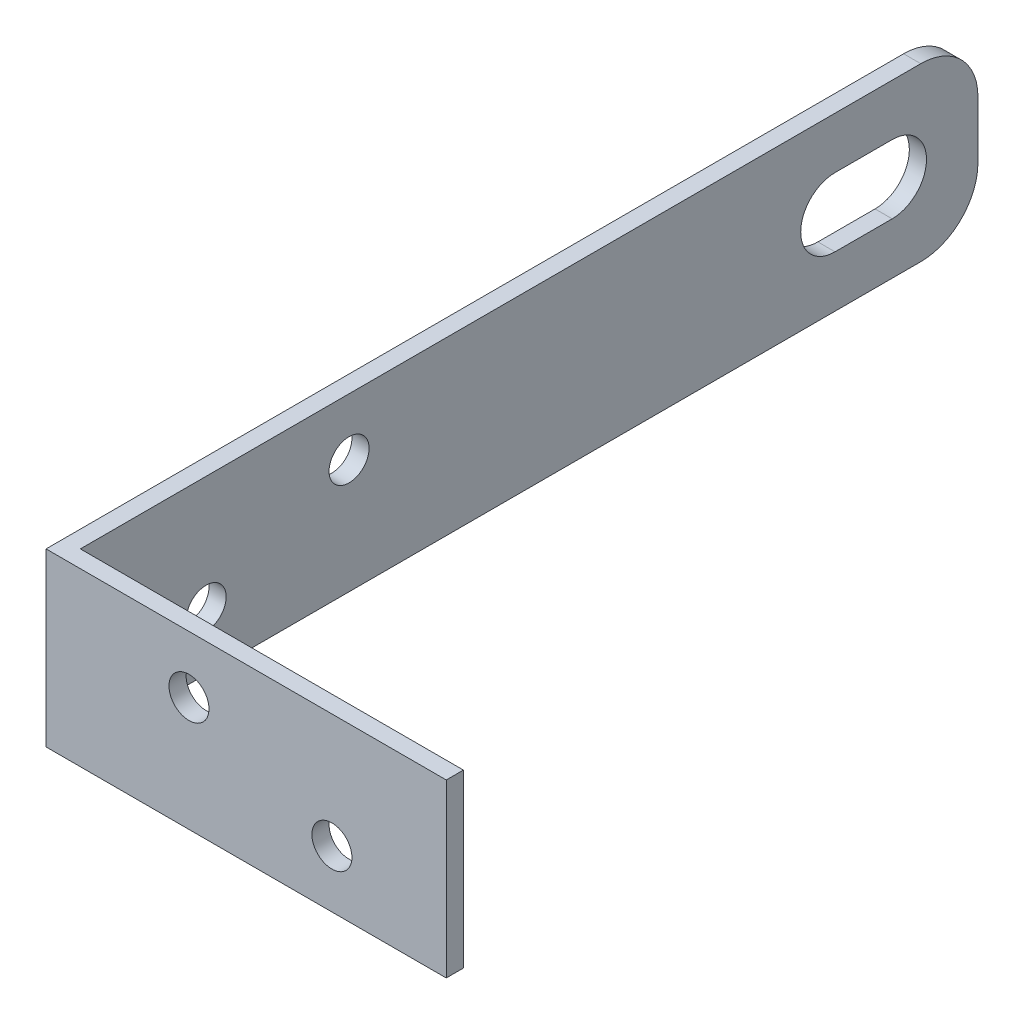
ISO-10303-21;
HEADER;
FILE_DESCRIPTION(('STEP AP214'),'2;1');
FILE_NAME('part.step','',(''),(''),'','','');
FILE_SCHEMA(('AUTOMOTIVE_DESIGN { 1 0 10303 214 1 1 1 1 }'));
ENDSEC;
DATA;
#1=APPLICATION_CONTEXT('core data for automotive mechanical design processes');
#2=APPLICATION_PROTOCOL_DEFINITION('international standard','automotive_design',2000,#1);
#3=PRODUCT_CONTEXT('',#1,'mechanical');
#4=PRODUCT('Part','Part','',(#3));
#5=PRODUCT_RELATED_PRODUCT_CATEGORY('part','',(#4));
#6=PRODUCT_DEFINITION_FORMATION('','',#4);
#7=PRODUCT_DEFINITION_CONTEXT('part definition',#1,'design');
#8=PRODUCT_DEFINITION('design','',#6,#7);
#9=PRODUCT_DEFINITION_SHAPE('','',#8);
#10=(LENGTH_UNIT() NAMED_UNIT(*) SI_UNIT(.MILLI.,.METRE.));
#11=(NAMED_UNIT(*) PLANE_ANGLE_UNIT() SI_UNIT($,.RADIAN.));
#12=(NAMED_UNIT(*) SI_UNIT($,.STERADIAN.) SOLID_ANGLE_UNIT());
#13=UNCERTAINTY_MEASURE_WITH_UNIT(LENGTH_MEASURE(1.E-05),#10,'distance_accuracy_value','');
#14=(GEOMETRIC_REPRESENTATION_CONTEXT(3) GLOBAL_UNCERTAINTY_ASSIGNED_CONTEXT((#13)) GLOBAL_UNIT_ASSIGNED_CONTEXT((#10,
#11,#12)) REPRESENTATION_CONTEXT('',''));
#15=CARTESIAN_POINT('',(0.,0.,0.));
#16=DIRECTION('',(0.,0.,1.));
#17=DIRECTION('',(1.,0.,0.));
#18=AXIS2_PLACEMENT_3D('',#15,#16,#17);
#19=CARTESIAN_POINT('',(0.,30.,-160.));
#20=DIRECTION('',(0.,0.,-1.));
#21=DIRECTION('',(-1.,0.,0.));
#22=AXIS2_PLACEMENT_3D('',#19,#20,#21);
#23=PLANE('',#22);
#24=DIRECTION('',(0.,-1.,0.));
#25=VECTOR('',#24,1.);
#26=CARTESIAN_POINT('',(0.,30.,-160.));
#27=LINE('',#26,#25);
#28=CARTESIAN_POINT('',(0.,20.,-160.));
#29=VERTEX_POINT('',#28);
#30=CARTESIAN_POINT('',(0.,10.,-160.));
#31=VERTEX_POINT('',#30);
#32=EDGE_CURVE('E135',#29,#31,#27,.T.);
#33=ORIENTED_EDGE('',*,*,#32,.F.);
#34=DIRECTION('',(-1.,0.,0.));
#35=VECTOR('',#34,1.);
#36=CARTESIAN_POINT('',(70.,20.,-160.));
#37=LINE('',#36,#35);
#38=CARTESIAN_POINT('',(3.,20.,-160.));
#39=VERTEX_POINT('',#38);
#40=EDGE_CURVE('E120',#39,#29,#37,.T.);
#41=ORIENTED_EDGE('',*,*,#40,.F.);
#42=DIRECTION('',(0.,-1.,0.));
#43=VECTOR('',#42,1.);
#44=CARTESIAN_POINT('',(3.,30.,-160.));
#45=LINE('',#44,#43);
#46=CARTESIAN_POINT('',(3.,10.,-160.));
#47=VERTEX_POINT('',#46);
#48=EDGE_CURVE('E141',#39,#47,#45,.T.);
#49=ORIENTED_EDGE('',*,*,#48,.T.);
#50=DIRECTION('',(-1.,0.,0.));
#51=VECTOR('',#50,1.);
#52=CARTESIAN_POINT('',(70.,10.,-160.));
#53=LINE('',#52,#51);
#54=EDGE_CURVE('E138',#47,#31,#53,.T.);
#55=ORIENTED_EDGE('',*,*,#54,.T.);
#56=EDGE_LOOP('',(#33,#41,#49,#55));
#57=FACE_BOUND('',#56,.T.);
#58=ADVANCED_FACE('F35',(#57),#23,.T.);
#59=CARTESIAN_POINT('',(0.,30.,0.));
#60=DIRECTION('',(0.,-1.,0.));
#61=DIRECTION('',(-1.,0.,0.));
#62=AXIS2_PLACEMENT_3D('',#59,#60,#61);
#63=PLANE('',#62);
#64=DIRECTION('',(-1.,0.,0.));
#65=VECTOR('',#64,1.);
#66=CARTESIAN_POINT('',(70.,30.,-150.));
#67=LINE('',#66,#65);
#68=CARTESIAN_POINT('',(0.,30.,-150.));
#69=VERTEX_POINT('',#68);
#70=CARTESIAN_POINT('',(3.,30.,-150.));
#71=VERTEX_POINT('',#70);
#72=EDGE_CURVE('E11',#69,#71,#67,.F.);
#73=ORIENTED_EDGE('',*,*,#72,.F.);
#74=DIRECTION('',(0.,0.,-1.));
#75=VECTOR('',#74,1.);
#76=CARTESIAN_POINT('',(0.,30.,-120.));
#77=LINE('',#76,#75);
#78=CARTESIAN_POINT('',(0.,30.,0.));
#79=VERTEX_POINT('',#78);
#80=EDGE_CURVE('E137',#79,#69,#77,.T.);
#81=ORIENTED_EDGE('',*,*,#80,.F.);
#82=DIRECTION('',(-1.,0.,0.));
#83=VECTOR('',#82,1.);
#84=CARTESIAN_POINT('',(0.,30.,0.));
#85=LINE('',#84,#83);
#86=CARTESIAN_POINT('',(70.,30.,0.));
#87=VERTEX_POINT('',#86);
#88=EDGE_CURVE('E222',#87,#79,#85,.T.);
#89=ORIENTED_EDGE('',*,*,#88,.F.);
#90=DIRECTION('',(0.,0.,1.));
#91=VECTOR('',#90,1.);
#92=CARTESIAN_POINT('',(70.,30.,-3.));
#93=LINE('',#92,#91);
#94=CARTESIAN_POINT('',(70.,30.,-3.));
#95=VERTEX_POINT('',#94);
#96=EDGE_CURVE('E210',#95,#87,#93,.T.);
#97=ORIENTED_EDGE('',*,*,#96,.F.);
#98=DIRECTION('',(1.,0.,0.));
#99=VECTOR('',#98,1.);
#100=CARTESIAN_POINT('',(0.,30.,-3.));
#101=LINE('',#100,#99);
#102=CARTESIAN_POINT('',(3.,30.,-3.));
#103=VERTEX_POINT('',#102);
#104=EDGE_CURVE('E202',#95,#103,#101,.F.);
#105=ORIENTED_EDGE('',*,*,#104,.T.);
#106=DIRECTION('',(0.,0.,-1.));
#107=VECTOR('',#106,1.);
#108=CARTESIAN_POINT('',(3.,30.,-120.));
#109=LINE('',#108,#107);
#110=EDGE_CURVE('E191',#103,#71,#109,.T.);
#111=ORIENTED_EDGE('',*,*,#110,.T.);
#112=EDGE_LOOP('',(#73,#81,#89,#97,#105,#111));
#113=FACE_BOUND('',#112,.T.);
#114=ADVANCED_FACE('F259',(#113),#63,.F.);
#115=CARTESIAN_POINT('',(0.,0.,0.));
#116=DIRECTION('',(0.,-1.,0.));
#117=DIRECTION('',(-1.,0.,0.));
#118=AXIS2_PLACEMENT_3D('',#115,#116,#117);
#119=PLANE('',#118);
#120=DIRECTION('',(0.,0.,-1.));
#121=VECTOR('',#120,1.);
#122=CARTESIAN_POINT('',(0.,0.,0.));
#123=LINE('',#122,#121);
#124=CARTESIAN_POINT('',(0.,0.,0.));
#125=VERTEX_POINT('',#124);
#126=CARTESIAN_POINT('',(0.,0.,-150.));
#127=VERTEX_POINT('',#126);
#128=EDGE_CURVE('E153',#125,#127,#123,.T.);
#129=ORIENTED_EDGE('',*,*,#128,.T.);
#130=DIRECTION('',(-1.,0.,0.));
#131=VECTOR('',#130,1.);
#132=CARTESIAN_POINT('',(70.,0.,-150.));
#133=LINE('',#132,#131);
#134=CARTESIAN_POINT('',(3.,0.,-150.));
#135=VERTEX_POINT('',#134);
#136=EDGE_CURVE('E42',#127,#135,#133,.F.);
#137=ORIENTED_EDGE('',*,*,#136,.T.);
#138=DIRECTION('',(0.,0.,-1.));
#139=VECTOR('',#138,1.);
#140=CARTESIAN_POINT('',(3.,0.,0.));
#141=LINE('',#140,#139);
#142=CARTESIAN_POINT('',(3.,0.,-3.));
#143=VERTEX_POINT('',#142);
#144=EDGE_CURVE('E183',#143,#135,#141,.T.);
#145=ORIENTED_EDGE('',*,*,#144,.F.);
#146=DIRECTION('',(1.,0.,0.));
#147=VECTOR('',#146,1.);
#148=CARTESIAN_POINT('',(0.,0.,-3.));
#149=LINE('',#148,#147);
#150=CARTESIAN_POINT('',(70.,0.,-3.));
#151=VERTEX_POINT('',#150);
#152=EDGE_CURVE('E192',#151,#143,#149,.F.);
#153=ORIENTED_EDGE('',*,*,#152,.F.);
#154=DIRECTION('',(0.,0.,1.));
#155=VECTOR('',#154,1.);
#156=CARTESIAN_POINT('',(70.,0.,-3.));
#157=LINE('',#156,#155);
#158=CARTESIAN_POINT('',(70.,0.,0.));
#159=VERTEX_POINT('',#158);
#160=EDGE_CURVE('E196',#151,#159,#157,.T.);
#161=ORIENTED_EDGE('',*,*,#160,.T.);
#162=DIRECTION('',(-1.,0.,0.));
#163=VECTOR('',#162,1.);
#164=CARTESIAN_POINT('',(0.,0.,0.));
#165=LINE('',#164,#163);
#166=EDGE_CURVE('E214',#159,#125,#165,.T.);
#167=ORIENTED_EDGE('',*,*,#166,.T.);
#168=EDGE_LOOP('',(#129,#137,#145,#153,#161,#167));
#169=FACE_BOUND('',#168,.T.);
#170=ADVANCED_FACE('F181',(#169),#119,.T.);
#171=CARTESIAN_POINT('',(0.,30.,0.));
#172=DIRECTION('',(-1.,0.,0.));
#173=DIRECTION('',(0.,0.,1.));
#174=AXIS2_PLACEMENT_3D('',#171,#172,#173);
#175=PLANE('',#174);
#176=CARTESIAN_POINT('',(0.,20.,-150.));
#177=DIRECTION('',(1.,0.,0.));
#178=DIRECTION('',(0.,0.,-1.));
#179=AXIS2_PLACEMENT_3D('',#176,#177,#178);
#180=CIRCLE('',#179,10.);
#181=EDGE_CURVE('E48',#29,#69,#180,.T.);
#182=ORIENTED_EDGE('',*,*,#181,.F.);
#183=ORIENTED_EDGE('',*,*,#32,.T.);
#184=CARTESIAN_POINT('',(0.,10.,-150.));
#185=DIRECTION('',(1.,0.,0.));
#186=DIRECTION('',(0.,0.,1.));
#187=AXIS2_PLACEMENT_3D('',#184,#185,#186);
#188=CIRCLE('',#187,10.);
#189=EDGE_CURVE('E256',#127,#31,#188,.T.);
#190=ORIENTED_EDGE('',*,*,#189,.F.);
#191=ORIENTED_EDGE('',*,*,#128,.F.);
#192=DIRECTION('',(0.,-1.,0.));
#193=VECTOR('',#192,1.);
#194=CARTESIAN_POINT('',(0.,30.,0.));
#195=LINE('',#194,#193);
#196=EDGE_CURVE('E142',#79,#125,#195,.T.);
#197=ORIENTED_EDGE('',*,*,#196,.F.);
#198=ORIENTED_EDGE('',*,*,#80,.T.);
#199=EDGE_LOOP('',(#182,#183,#190,#191,#197,#198));
#200=FACE_BOUND('',#199,.T.);
#201=CARTESIAN_POINT('',(0.,15.,-145.));
#202=DIRECTION('',(-1.,0.,0.));
#203=DIRECTION('',(0.,0.,1.));
#204=AXIS2_PLACEMENT_3D('',#201,#202,#203);
#205=CIRCLE('',#204,6.);
#206=CARTESIAN_POINT('',(0.,21.,-145.));
#207=VERTEX_POINT('',#206);
#208=CARTESIAN_POINT('',(0.,9.,-145.));
#209=VERTEX_POINT('',#208);
#210=EDGE_CURVE('E251',#207,#209,#205,.T.);
#211=ORIENTED_EDGE('',*,*,#210,.F.);
#212=DIRECTION('',(0.,0.,-1.));
#213=VECTOR('',#212,1.);
#214=CARTESIAN_POINT('',(0.,21.,-145.));
#215=LINE('',#214,#213);
#216=CARTESIAN_POINT('',(0.,21.,-135.));
#217=VERTEX_POINT('',#216);
#218=EDGE_CURVE('E238',#217,#207,#215,.T.);
#219=ORIENTED_EDGE('',*,*,#218,.F.);
#220=CARTESIAN_POINT('',(0.,15.,-135.));
#221=DIRECTION('',(-1.,0.,0.));
#222=DIRECTION('',(0.,0.,-1.));
#223=AXIS2_PLACEMENT_3D('',#220,#221,#222);
#224=CIRCLE('',#223,6.);
#225=CARTESIAN_POINT('',(0.,9.,-135.));
#226=VERTEX_POINT('',#225);
#227=EDGE_CURVE('E245',#226,#217,#224,.T.);
#228=ORIENTED_EDGE('',*,*,#227,.F.);
#229=DIRECTION('',(0.,0.,1.));
#230=VECTOR('',#229,1.);
#231=CARTESIAN_POINT('',(0.,9.,-145.));
#232=LINE('',#231,#230);
#233=EDGE_CURVE('E248',#209,#226,#232,.T.);
#234=ORIENTED_EDGE('',*,*,#233,.F.);
#235=EDGE_LOOP('',(#211,#219,#228,#234));
#236=FACE_BOUND('',#235,.T.);
#237=CARTESIAN_POINT('',(0.,10.,-25.));
#238=DIRECTION('',(-1.,0.,0.));
#239=DIRECTION('',(0.,0.,1.));
#240=AXIS2_PLACEMENT_3D('',#237,#238,#239);
#241=CIRCLE('',#240,3.50000000000002);
#242=CARTESIAN_POINT('',(0.,10.,-21.5));
#243=VERTEX_POINT('',#242);
#244=EDGE_CURVE('E158',#243,#243,#241,.T.);
#245=ORIENTED_EDGE('',*,*,#244,.F.);
#246=EDGE_LOOP('',(#245));
#247=FACE_BOUND('',#246,.T.);
#248=CARTESIAN_POINT('',(0.,20.,-50.));
#249=DIRECTION('',(-1.,0.,0.));
#250=DIRECTION('',(0.,0.,1.));
#251=AXIS2_PLACEMENT_3D('',#248,#249,#250);
#252=CIRCLE('',#251,3.5);
#253=CARTESIAN_POINT('',(0.,20.,-46.5));
#254=VERTEX_POINT('',#253);
#255=EDGE_CURVE('E154',#254,#254,#252,.T.);
#256=ORIENTED_EDGE('',*,*,#255,.F.);
#257=EDGE_LOOP('',(#256));
#258=FACE_BOUND('',#257,.T.);
#259=ADVANCED_FACE('F132',(#200,#236,#247,#258),#175,.T.);
#260=CARTESIAN_POINT('',(0.,30.,0.));
#261=DIRECTION('',(0.,0.,1.));
#262=DIRECTION('',(1.,0.,0.));
#263=AXIS2_PLACEMENT_3D('',#260,#261,#262);
#264=PLANE('',#263);
#265=CARTESIAN_POINT('',(50.,10.,0.));
#266=DIRECTION('',(0.,0.,1.));
#267=DIRECTION('',(1.,0.,0.));
#268=AXIS2_PLACEMENT_3D('',#265,#266,#267);
#269=CIRCLE('',#268,3.5);
#270=CARTESIAN_POINT('',(53.5,10.,0.));
#271=VERTEX_POINT('',#270);
#272=EDGE_CURVE('E166',#271,#271,#269,.T.);
#273=ORIENTED_EDGE('',*,*,#272,.F.);
#274=EDGE_LOOP('',(#273));
#275=FACE_BOUND('',#274,.T.);
#276=CARTESIAN_POINT('',(25.,20.,0.));
#277=DIRECTION('',(0.,0.,1.));
#278=DIRECTION('',(1.,0.,0.));
#279=AXIS2_PLACEMENT_3D('',#276,#277,#278);
#280=CIRCLE('',#279,3.5);
#281=CARTESIAN_POINT('',(28.5,20.,0.));
#282=VERTEX_POINT('',#281);
#283=EDGE_CURVE('E162',#282,#282,#280,.T.);
#284=ORIENTED_EDGE('',*,*,#283,.F.);
#285=EDGE_LOOP('',(#284));
#286=FACE_BOUND('',#285,.T.);
#287=ORIENTED_EDGE('',*,*,#166,.F.);
#288=DIRECTION('',(0.,-1.,0.));
#289=VECTOR('',#288,1.);
#290=CARTESIAN_POINT('',(70.,30.,0.));
#291=LINE('',#290,#289);
#292=EDGE_CURVE('E146',#87,#159,#291,.T.);
#293=ORIENTED_EDGE('',*,*,#292,.F.);
#294=ORIENTED_EDGE('',*,*,#88,.T.);
#295=ORIENTED_EDGE('',*,*,#196,.T.);
#296=EDGE_LOOP('',(#287,#293,#294,#295));
#297=FACE_BOUND('',#296,.T.);
#298=ADVANCED_FACE('F215',(#275,#286,#297),#264,.T.);
#299=CARTESIAN_POINT('',(70.,30.,-3.));
#300=DIRECTION('',(1.,0.,0.));
#301=DIRECTION('',(0.,0.,-1.));
#302=AXIS2_PLACEMENT_3D('',#299,#300,#301);
#303=PLANE('',#302);
#304=ORIENTED_EDGE('',*,*,#160,.F.);
#305=DIRECTION('',(0.,-1.,0.));
#306=VECTOR('',#305,1.);
#307=CARTESIAN_POINT('',(70.,30.,-3.));
#308=LINE('',#307,#306);
#309=EDGE_CURVE('E201',#95,#151,#308,.T.);
#310=ORIENTED_EDGE('',*,*,#309,.F.);
#311=ORIENTED_EDGE('',*,*,#96,.T.);
#312=ORIENTED_EDGE('',*,*,#292,.T.);
#313=EDGE_LOOP('',(#304,#310,#311,#312));
#314=FACE_BOUND('',#313,.T.);
#315=ADVANCED_FACE('F207',(#314),#303,.T.);
#316=CARTESIAN_POINT('',(0.,30.,-3.));
#317=DIRECTION('',(0.,0.,1.));
#318=DIRECTION('',(1.,0.,0.));
#319=AXIS2_PLACEMENT_3D('',#316,#317,#318);
#320=PLANE('',#319);
#321=CARTESIAN_POINT('',(50.,10.,-3.));
#322=DIRECTION('',(0.,0.,1.));
#323=DIRECTION('',(1.,0.,0.));
#324=AXIS2_PLACEMENT_3D('',#321,#322,#323);
#325=CIRCLE('',#324,3.5);
#326=CARTESIAN_POINT('',(53.5,10.,-3.));
#327=VERTEX_POINT('',#326);
#328=EDGE_CURVE('E163',#327,#327,#325,.T.);
#329=ORIENTED_EDGE('',*,*,#328,.T.);
#330=EDGE_LOOP('',(#329));
#331=FACE_BOUND('',#330,.T.);
#332=CARTESIAN_POINT('',(25.,20.,-3.));
#333=DIRECTION('',(0.,0.,1.));
#334=DIRECTION('',(1.,0.,0.));
#335=AXIS2_PLACEMENT_3D('',#332,#333,#334);
#336=CIRCLE('',#335,3.5);
#337=CARTESIAN_POINT('',(28.5,20.,-3.));
#338=VERTEX_POINT('',#337);
#339=EDGE_CURVE('E159',#338,#338,#336,.T.);
#340=ORIENTED_EDGE('',*,*,#339,.T.);
#341=EDGE_LOOP('',(#340));
#342=FACE_BOUND('',#341,.T.);
#343=ORIENTED_EDGE('',*,*,#152,.T.);
#344=DIRECTION('',(0.,-1.,0.));
#345=VECTOR('',#344,1.);
#346=CARTESIAN_POINT('',(3.,30.,-3.));
#347=LINE('',#346,#345);
#348=EDGE_CURVE('E190',#103,#143,#347,.T.);
#349=ORIENTED_EDGE('',*,*,#348,.F.);
#350=ORIENTED_EDGE('',*,*,#104,.F.);
#351=ORIENTED_EDGE('',*,*,#309,.T.);
#352=EDGE_LOOP('',(#343,#349,#350,#351));
#353=FACE_BOUND('',#352,.T.);
#354=ADVANCED_FACE('F262',(#331,#342,#353),#320,.F.);
#355=CARTESIAN_POINT('',(3.,30.,0.));
#356=DIRECTION('',(-1.,0.,0.));
#357=DIRECTION('',(0.,0.,1.));
#358=AXIS2_PLACEMENT_3D('',#355,#356,#357);
#359=PLANE('',#358);
#360=DIRECTION('',(0.,0.,-1.));
#361=VECTOR('',#360,1.);
#362=CARTESIAN_POINT('',(3.,21.,0.));
#363=LINE('',#362,#361);
#364=CARTESIAN_POINT('',(3.,21.,-135.));
#365=VERTEX_POINT('',#364);
#366=CARTESIAN_POINT('',(3.,21.,-145.));
#367=VERTEX_POINT('',#366);
#368=EDGE_CURVE('E172',#365,#367,#363,.T.);
#369=ORIENTED_EDGE('',*,*,#368,.T.);
#370=CARTESIAN_POINT('',(3.,15.,-145.));
#371=DIRECTION('',(-1.,0.,0.));
#372=DIRECTION('',(0.,0.,1.));
#373=AXIS2_PLACEMENT_3D('',#370,#371,#372);
#374=CIRCLE('',#373,6.);
#375=CARTESIAN_POINT('',(3.,9.,-145.));
#376=VERTEX_POINT('',#375);
#377=EDGE_CURVE('E175',#367,#376,#374,.T.);
#378=ORIENTED_EDGE('',*,*,#377,.T.);
#379=DIRECTION('',(0.,0.,1.));
#380=VECTOR('',#379,1.);
#381=CARTESIAN_POINT('',(3.,9.,0.));
#382=LINE('',#381,#380);
#383=CARTESIAN_POINT('',(3.,9.,-135.));
#384=VERTEX_POINT('',#383);
#385=EDGE_CURVE('E144',#376,#384,#382,.T.);
#386=ORIENTED_EDGE('',*,*,#385,.T.);
#387=CARTESIAN_POINT('',(3.,15.,-135.));
#388=DIRECTION('',(-1.,0.,0.));
#389=DIRECTION('',(0.,0.,1.));
#390=AXIS2_PLACEMENT_3D('',#387,#388,#389);
#391=CIRCLE('',#390,6.);
#392=EDGE_CURVE('E169',#384,#365,#391,.T.);
#393=ORIENTED_EDGE('',*,*,#392,.T.);
#394=EDGE_LOOP('',(#369,#378,#386,#393));
#395=FACE_BOUND('',#394,.T.);
#396=CARTESIAN_POINT('',(3.,10.,-25.));
#397=DIRECTION('',(-1.,0.,0.));
#398=DIRECTION('',(0.,0.,1.));
#399=AXIS2_PLACEMENT_3D('',#396,#397,#398);
#400=CIRCLE('',#399,3.50000000000002);
#401=CARTESIAN_POINT('',(3.,10.,-21.5));
#402=VERTEX_POINT('',#401);
#403=EDGE_CURVE('E155',#402,#402,#400,.T.);
#404=ORIENTED_EDGE('',*,*,#403,.T.);
#405=EDGE_LOOP('',(#404));
#406=FACE_BOUND('',#405,.T.);
#407=CARTESIAN_POINT('',(3.,20.,-50.));
#408=DIRECTION('',(-1.,0.,0.));
#409=DIRECTION('',(0.,0.,1.));
#410=AXIS2_PLACEMENT_3D('',#407,#408,#409);
#411=CIRCLE('',#410,3.5);
#412=CARTESIAN_POINT('',(3.,20.,-46.5));
#413=VERTEX_POINT('',#412);
#414=EDGE_CURVE('E150',#413,#413,#411,.T.);
#415=ORIENTED_EDGE('',*,*,#414,.T.);
#416=EDGE_LOOP('',(#415));
#417=FACE_BOUND('',#416,.T.);
#418=ORIENTED_EDGE('',*,*,#48,.F.);
#419=CARTESIAN_POINT('',(3.,20.,-150.));
#420=DIRECTION('',(-1.,0.,0.));
#421=DIRECTION('',(0.,0.,1.));
#422=AXIS2_PLACEMENT_3D('',#419,#420,#421);
#423=CIRCLE('',#422,10.);
#424=EDGE_CURVE('E123',#39,#71,#423,.F.);
#425=ORIENTED_EDGE('',*,*,#424,.T.);
#426=ORIENTED_EDGE('',*,*,#110,.F.);
#427=ORIENTED_EDGE('',*,*,#348,.T.);
#428=ORIENTED_EDGE('',*,*,#144,.T.);
#429=CARTESIAN_POINT('',(3.,10.,-150.));
#430=DIRECTION('',(-1.,0.,0.));
#431=DIRECTION('',(0.,0.,1.));
#432=AXIS2_PLACEMENT_3D('',#429,#430,#431);
#433=CIRCLE('',#432,10.);
#434=EDGE_CURVE('E56',#135,#47,#433,.F.);
#435=ORIENTED_EDGE('',*,*,#434,.T.);
#436=EDGE_LOOP('',(#418,#425,#426,#427,#428,#435));
#437=FACE_BOUND('',#436,.T.);
#438=ADVANCED_FACE('F188',(#395,#406,#417,#437),#359,.F.);
#439=CARTESIAN_POINT('',(70.,20.,-50.));
#440=DIRECTION('',(-1.,0.,0.));
#441=DIRECTION('',(0.,0.,1.));
#442=AXIS2_PLACEMENT_3D('',#439,#440,#441);
#443=CYLINDRICAL_SURFACE('',#442,3.5);
#444=ORIENTED_EDGE('',*,*,#255,.T.);
#445=EDGE_LOOP('',(#444));
#446=FACE_BOUND('',#445,.T.);
#447=ORIENTED_EDGE('',*,*,#414,.F.);
#448=EDGE_LOOP('',(#447));
#449=FACE_BOUND('',#448,.T.);
#450=ADVANCED_FACE('F270',(#446,#449),#443,.F.);
#451=CARTESIAN_POINT('',(70.,10.,-25.));
#452=DIRECTION('',(-1.,0.,0.));
#453=DIRECTION('',(0.,0.,1.));
#454=AXIS2_PLACEMENT_3D('',#451,#452,#453);
#455=CYLINDRICAL_SURFACE('',#454,3.50000000000002);
#456=ORIENTED_EDGE('',*,*,#244,.T.);
#457=EDGE_LOOP('',(#456));
#458=FACE_BOUND('',#457,.T.);
#459=ORIENTED_EDGE('',*,*,#403,.F.);
#460=EDGE_LOOP('',(#459));
#461=FACE_BOUND('',#460,.T.);
#462=ADVANCED_FACE('F287',(#458,#461),#455,.F.);
#463=CARTESIAN_POINT('',(25.,20.,-160.));
#464=DIRECTION('',(0.,0.,1.));
#465=DIRECTION('',(1.,0.,0.));
#466=AXIS2_PLACEMENT_3D('',#463,#464,#465);
#467=CYLINDRICAL_SURFACE('',#466,3.5);
#468=ORIENTED_EDGE('',*,*,#283,.T.);
#469=EDGE_LOOP('',(#468));
#470=FACE_BOUND('',#469,.T.);
#471=ORIENTED_EDGE('',*,*,#339,.F.);
#472=EDGE_LOOP('',(#471));
#473=FACE_BOUND('',#472,.T.);
#474=ADVANCED_FACE('F291',(#470,#473),#467,.F.);
#475=CARTESIAN_POINT('',(50.,10.,-160.));
#476=DIRECTION('',(0.,0.,1.));
#477=DIRECTION('',(1.,0.,0.));
#478=AXIS2_PLACEMENT_3D('',#475,#476,#477);
#479=CYLINDRICAL_SURFACE('',#478,3.5);
#480=ORIENTED_EDGE('',*,*,#272,.T.);
#481=EDGE_LOOP('',(#480));
#482=FACE_BOUND('',#481,.T.);
#483=ORIENTED_EDGE('',*,*,#328,.F.);
#484=EDGE_LOOP('',(#483));
#485=FACE_BOUND('',#484,.T.);
#486=ADVANCED_FACE('F295',(#482,#485),#479,.F.);
#487=CARTESIAN_POINT('',(70.,15.,-145.));
#488=DIRECTION('',(-1.,0.,0.));
#489=DIRECTION('',(0.,0.,1.));
#490=AXIS2_PLACEMENT_3D('',#487,#488,#489);
#491=CYLINDRICAL_SURFACE('',#490,6.);
#492=DIRECTION('',(-1.,0.,0.));
#493=VECTOR('',#492,1.);
#494=CARTESIAN_POINT('',(70.,21.,-145.));
#495=LINE('',#494,#493);
#496=EDGE_CURVE('E233',#367,#207,#495,.T.);
#497=ORIENTED_EDGE('',*,*,#496,.T.);
#498=ORIENTED_EDGE('',*,*,#210,.T.);
#499=DIRECTION('',(-1.,0.,0.));
#500=VECTOR('',#499,1.);
#501=CARTESIAN_POINT('',(70.,9.,-145.));
#502=LINE('',#501,#500);
#503=EDGE_CURVE('E234',#376,#209,#502,.T.);
#504=ORIENTED_EDGE('',*,*,#503,.F.);
#505=ORIENTED_EDGE('',*,*,#377,.F.);
#506=EDGE_LOOP('',(#497,#498,#504,#505));
#507=FACE_BOUND('',#506,.T.);
#508=ADVANCED_FACE('F299',(#507),#491,.F.);
#509=CARTESIAN_POINT('',(70.,21.,-145.));
#510=DIRECTION('',(0.,1.,0.));
#511=DIRECTION('',(0.,0.,1.));
#512=AXIS2_PLACEMENT_3D('',#509,#510,#511);
#513=PLANE('',#512);
#514=DIRECTION('',(-1.,0.,0.));
#515=VECTOR('',#514,1.);
#516=CARTESIAN_POINT('',(70.,21.,-135.));
#517=LINE('',#516,#515);
#518=EDGE_CURVE('E240',#365,#217,#517,.T.);
#519=ORIENTED_EDGE('',*,*,#518,.T.);
#520=ORIENTED_EDGE('',*,*,#218,.T.);
#521=ORIENTED_EDGE('',*,*,#496,.F.);
#522=ORIENTED_EDGE('',*,*,#368,.F.);
#523=EDGE_LOOP('',(#519,#520,#521,#522));
#524=FACE_BOUND('',#523,.T.);
#525=ADVANCED_FACE('F303',(#524),#513,.F.);
#526=CARTESIAN_POINT('',(70.,15.,-135.));
#527=DIRECTION('',(-1.,0.,0.));
#528=DIRECTION('',(0.,0.,1.));
#529=AXIS2_PLACEMENT_3D('',#526,#527,#528);
#530=CYLINDRICAL_SURFACE('',#529,6.);
#531=DIRECTION('',(-1.,0.,0.));
#532=VECTOR('',#531,1.);
#533=CARTESIAN_POINT('',(70.,9.,-135.));
#534=LINE('',#533,#532);
#535=EDGE_CURVE('E237',#384,#226,#534,.T.);
#536=ORIENTED_EDGE('',*,*,#535,.T.);
#537=ORIENTED_EDGE('',*,*,#227,.T.);
#538=ORIENTED_EDGE('',*,*,#518,.F.);
#539=ORIENTED_EDGE('',*,*,#392,.F.);
#540=EDGE_LOOP('',(#536,#537,#538,#539));
#541=FACE_BOUND('',#540,.T.);
#542=ADVANCED_FACE('F308',(#541),#530,.F.);
#543=CARTESIAN_POINT('',(70.,9.,-145.));
#544=DIRECTION('',(0.,-1.,0.));
#545=DIRECTION('',(0.,0.,-1.));
#546=AXIS2_PLACEMENT_3D('',#543,#544,#545);
#547=PLANE('',#546);
#548=ORIENTED_EDGE('',*,*,#503,.T.);
#549=ORIENTED_EDGE('',*,*,#233,.T.);
#550=ORIENTED_EDGE('',*,*,#535,.F.);
#551=ORIENTED_EDGE('',*,*,#385,.F.);
#552=EDGE_LOOP('',(#548,#549,#550,#551));
#553=FACE_BOUND('',#552,.T.);
#554=ADVANCED_FACE('F305',(#553),#547,.F.);
#555=CARTESIAN_POINT('',(70.,10.,-150.));
#556=DIRECTION('',(-1.,0.,0.));
#557=DIRECTION('',(0.,0.,1.));
#558=AXIS2_PLACEMENT_3D('',#555,#556,#557);
#559=CYLINDRICAL_SURFACE('',#558,10.);
#560=ORIENTED_EDGE('',*,*,#136,.F.);
#561=ORIENTED_EDGE('',*,*,#189,.T.);
#562=ORIENTED_EDGE('',*,*,#54,.F.);
#563=ORIENTED_EDGE('',*,*,#434,.F.);
#564=EDGE_LOOP('',(#560,#561,#562,#563));
#565=FACE_BOUND('',#564,.T.);
#566=ADVANCED_FACE('F257',(#565),#559,.T.);
#567=CARTESIAN_POINT('',(70.,20.,-150.));
#568=DIRECTION('',(-1.,0.,0.));
#569=DIRECTION('',(0.,0.,1.));
#570=AXIS2_PLACEMENT_3D('',#567,#568,#569);
#571=CYLINDRICAL_SURFACE('',#570,10.);
#572=ORIENTED_EDGE('',*,*,#40,.T.);
#573=ORIENTED_EDGE('',*,*,#181,.T.);
#574=ORIENTED_EDGE('',*,*,#72,.T.);
#575=ORIENTED_EDGE('',*,*,#424,.F.);
#576=EDGE_LOOP('',(#572,#573,#574,#575));
#577=FACE_BOUND('',#576,.T.);
#578=ADVANCED_FACE('F121',(#577),#571,.T.);
#579=CLOSED_SHELL('',(#58,#114,#170,#259,#298,#315,#354,#438,#450,#462,#474,#486,#508,#525,#542,
#554,#566,#578));
#580=MANIFOLD_SOLID_BREP('B2',#579);
#581=ADVANCED_BREP_SHAPE_REPRESENTATION('',(#18,#580),#14);
#582=SHAPE_DEFINITION_REPRESENTATION(#9,#581);
ENDSEC;
END-ISO-10303-21;
